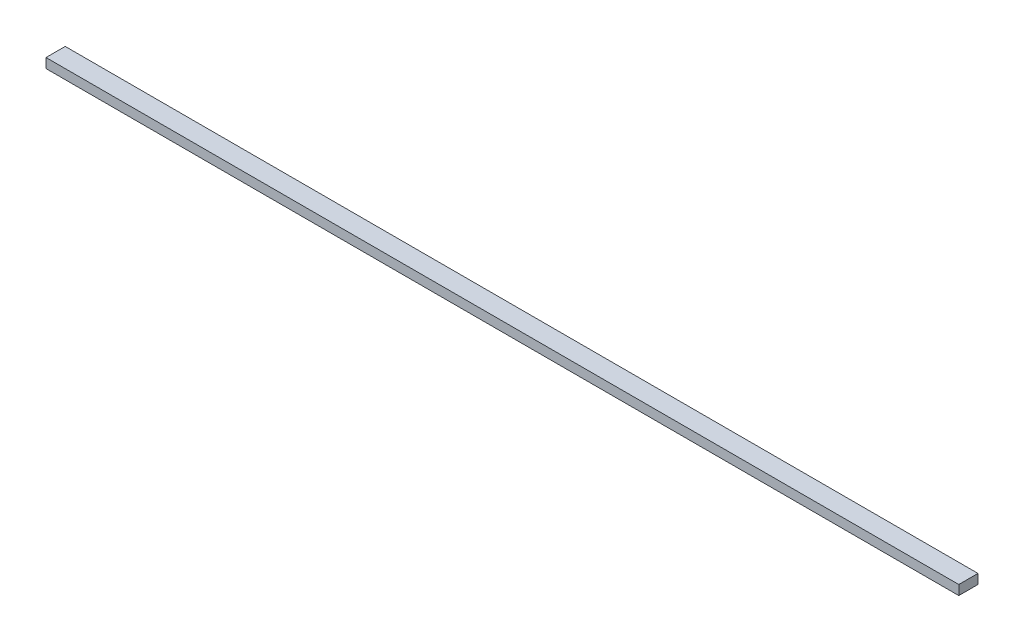
ISO-10303-21;
HEADER;
FILE_DESCRIPTION(('STEP AP214'),'2;1');
FILE_NAME('part.step','',(''),(''),'','','');
FILE_SCHEMA(('AUTOMOTIVE_DESIGN { 1 0 10303 214 1 1 1 1 }'));
ENDSEC;
DATA;
#1=APPLICATION_CONTEXT('core data for automotive mechanical design processes');
#2=APPLICATION_PROTOCOL_DEFINITION('international standard','automotive_design',2000,#1);
#3=PRODUCT_CONTEXT('',#1,'mechanical');
#4=PRODUCT('Part','Part','',(#3));
#5=PRODUCT_RELATED_PRODUCT_CATEGORY('part','',(#4));
#6=PRODUCT_DEFINITION_FORMATION('','',#4);
#7=PRODUCT_DEFINITION_CONTEXT('part definition',#1,'design');
#8=PRODUCT_DEFINITION('design','',#6,#7);
#9=PRODUCT_DEFINITION_SHAPE('','',#8);
#10=(LENGTH_UNIT() NAMED_UNIT(*) SI_UNIT(.MILLI.,.METRE.));
#11=(NAMED_UNIT(*) PLANE_ANGLE_UNIT() SI_UNIT($,.RADIAN.));
#12=(NAMED_UNIT(*) SI_UNIT($,.STERADIAN.) SOLID_ANGLE_UNIT());
#13=UNCERTAINTY_MEASURE_WITH_UNIT(LENGTH_MEASURE(1.E-05),#10,'distance_accuracy_value','');
#14=(GEOMETRIC_REPRESENTATION_CONTEXT(3) GLOBAL_UNCERTAINTY_ASSIGNED_CONTEXT((#13)) GLOBAL_UNIT_ASSIGNED_CONTEXT((#10,
#11,#12)) REPRESENTATION_CONTEXT('',''));
#15=CARTESIAN_POINT('',(0.,0.,0.));
#16=DIRECTION('',(0.,0.,1.));
#17=DIRECTION('',(1.,0.,0.));
#18=AXIS2_PLACEMENT_3D('',#15,#16,#17);
#19=CARTESIAN_POINT('',(0.,0.,100.));
#20=DIRECTION('',(1.,0.,0.));
#21=DIRECTION('',(0.,0.,-1.));
#22=AXIS2_PLACEMENT_3D('',#19,#20,#21);
#23=PLANE('',#22);
#24=DIRECTION('',(0.,-1.,0.));
#25=VECTOR('',#24,1.);
#26=CARTESIAN_POINT('',(0.,0.,0.));
#27=LINE('',#26,#25);
#28=CARTESIAN_POINT('',(0.,50.,0.));
#29=VERTEX_POINT('',#28);
#30=CARTESIAN_POINT('',(0.,0.,0.));
#31=VERTEX_POINT('',#30);
#32=EDGE_CURVE('E100',#29,#31,#27,.T.);
#33=ORIENTED_EDGE('',*,*,#32,.T.);
#34=DIRECTION('',(0.,0.,-1.));
#35=VECTOR('',#34,1.);
#36=CARTESIAN_POINT('',(0.,0.,100.));
#37=LINE('',#36,#35);
#38=CARTESIAN_POINT('',(0.,0.,100.));
#39=VERTEX_POINT('',#38);
#40=EDGE_CURVE('E11',#39,#31,#37,.T.);
#41=ORIENTED_EDGE('',*,*,#40,.F.);
#42=DIRECTION('',(0.,-1.,0.));
#43=VECTOR('',#42,1.);
#44=CARTESIAN_POINT('',(0.,0.,100.));
#45=LINE('',#44,#43);
#46=CARTESIAN_POINT('',(0.,50.,100.));
#47=VERTEX_POINT('',#46);
#48=EDGE_CURVE('E88',#47,#39,#45,.T.);
#49=ORIENTED_EDGE('',*,*,#48,.F.);
#50=DIRECTION('',(0.,0.,-1.));
#51=VECTOR('',#50,1.);
#52=CARTESIAN_POINT('',(0.,50.,100.));
#53=LINE('',#52,#51);
#54=EDGE_CURVE('E96',#47,#29,#53,.T.);
#55=ORIENTED_EDGE('',*,*,#54,.T.);
#56=EDGE_LOOP('',(#33,#41,#49,#55));
#57=FACE_BOUND('',#56,.T.);
#58=ADVANCED_FACE('F37',(#57),#23,.F.);
#59=CARTESIAN_POINT('',(0.,0.,100.));
#60=DIRECTION('',(0.,1.,0.));
#61=DIRECTION('',(0.,0.,1.));
#62=AXIS2_PLACEMENT_3D('',#59,#60,#61);
#63=PLANE('',#62);
#64=DIRECTION('',(1.,0.,0.));
#65=VECTOR('',#64,1.);
#66=CARTESIAN_POINT('',(0.,0.,0.));
#67=LINE('',#66,#65);
#68=CARTESIAN_POINT('',(4750.,0.,0.));
#69=VERTEX_POINT('',#68);
#70=EDGE_CURVE('E92',#31,#69,#67,.T.);
#71=ORIENTED_EDGE('',*,*,#70,.T.);
#72=DIRECTION('',(0.,0.,-1.));
#73=VECTOR('',#72,1.);
#74=CARTESIAN_POINT('',(4750.,0.,100.));
#75=LINE('',#74,#73);
#76=CARTESIAN_POINT('',(4750.,0.,100.));
#77=VERTEX_POINT('',#76);
#78=EDGE_CURVE('E45',#77,#69,#75,.T.);
#79=ORIENTED_EDGE('',*,*,#78,.F.);
#80=DIRECTION('',(1.,0.,0.));
#81=VECTOR('',#80,1.);
#82=CARTESIAN_POINT('',(0.,0.,100.));
#83=LINE('',#82,#81);
#84=EDGE_CURVE('E83',#39,#77,#83,.T.);
#85=ORIENTED_EDGE('',*,*,#84,.F.);
#86=ORIENTED_EDGE('',*,*,#40,.T.);
#87=EDGE_LOOP('',(#71,#79,#85,#86));
#88=FACE_BOUND('',#87,.T.);
#89=ADVANCED_FACE('F91',(#88),#63,.F.);
#90=CARTESIAN_POINT('',(4750.,0.,100.));
#91=DIRECTION('',(-1.,0.,0.));
#92=DIRECTION('',(0.,0.,1.));
#93=AXIS2_PLACEMENT_3D('',#90,#91,#92);
#94=PLANE('',#93);
#95=DIRECTION('',(0.,1.,0.));
#96=VECTOR('',#95,1.);
#97=CARTESIAN_POINT('',(4750.,0.,0.));
#98=LINE('',#97,#96);
#99=CARTESIAN_POINT('',(4750.,50.,0.));
#100=VERTEX_POINT('',#99);
#101=EDGE_CURVE('E70',#69,#100,#98,.T.);
#102=ORIENTED_EDGE('',*,*,#101,.T.);
#103=DIRECTION('',(0.,0.,-1.));
#104=VECTOR('',#103,1.);
#105=CARTESIAN_POINT('',(4750.,50.,100.));
#106=LINE('',#105,#104);
#107=CARTESIAN_POINT('',(4750.,50.,100.));
#108=VERTEX_POINT('',#107);
#109=EDGE_CURVE('E93',#108,#100,#106,.T.);
#110=ORIENTED_EDGE('',*,*,#109,.F.);
#111=DIRECTION('',(0.,1.,0.));
#112=VECTOR('',#111,1.);
#113=CARTESIAN_POINT('',(4750.,0.,100.));
#114=LINE('',#113,#112);
#115=EDGE_CURVE('E86',#77,#108,#114,.T.);
#116=ORIENTED_EDGE('',*,*,#115,.F.);
#117=ORIENTED_EDGE('',*,*,#78,.T.);
#118=EDGE_LOOP('',(#102,#110,#116,#117));
#119=FACE_BOUND('',#118,.T.);
#120=ADVANCED_FACE('F94',(#119),#94,.F.);
#121=CARTESIAN_POINT('',(0.,50.,100.));
#122=DIRECTION('',(0.,-1.,0.));
#123=DIRECTION('',(0.,0.,-1.));
#124=AXIS2_PLACEMENT_3D('',#121,#122,#123);
#125=PLANE('',#124);
#126=DIRECTION('',(-1.,0.,0.));
#127=VECTOR('',#126,1.);
#128=CARTESIAN_POINT('',(0.,50.,0.));
#129=LINE('',#128,#127);
#130=EDGE_CURVE('E76',#100,#29,#129,.T.);
#131=ORIENTED_EDGE('',*,*,#130,.T.);
#132=ORIENTED_EDGE('',*,*,#54,.F.);
#133=DIRECTION('',(-1.,0.,0.));
#134=VECTOR('',#133,1.);
#135=CARTESIAN_POINT('',(0.,50.,100.));
#136=LINE('',#135,#134);
#137=EDGE_CURVE('E53',#108,#47,#136,.T.);
#138=ORIENTED_EDGE('',*,*,#137,.F.);
#139=ORIENTED_EDGE('',*,*,#109,.T.);
#140=EDGE_LOOP('',(#131,#132,#138,#139));
#141=FACE_BOUND('',#140,.T.);
#142=ADVANCED_FACE('F107',(#141),#125,.F.);
#143=CARTESIAN_POINT('',(0.,0.,100.));
#144=DIRECTION('',(0.,0.,-1.));
#145=DIRECTION('',(-1.,0.,0.));
#146=AXIS2_PLACEMENT_3D('',#143,#144,#145);
#147=PLANE('',#146);
#148=ORIENTED_EDGE('',*,*,#48,.T.);
#149=ORIENTED_EDGE('',*,*,#84,.T.);
#150=ORIENTED_EDGE('',*,*,#115,.T.);
#151=ORIENTED_EDGE('',*,*,#137,.T.);
#152=EDGE_LOOP('',(#148,#149,#150,#151));
#153=FACE_BOUND('',#152,.T.);
#154=ADVANCED_FACE('F84',(#153),#147,.F.);
#155=CARTESIAN_POINT('',(0.,0.,0.));
#156=DIRECTION('',(0.,0.,-1.));
#157=DIRECTION('',(-1.,0.,0.));
#158=AXIS2_PLACEMENT_3D('',#155,#156,#157);
#159=PLANE('',#158);
#160=ORIENTED_EDGE('',*,*,#32,.F.);
#161=ORIENTED_EDGE('',*,*,#130,.F.);
#162=ORIENTED_EDGE('',*,*,#101,.F.);
#163=ORIENTED_EDGE('',*,*,#70,.F.);
#164=EDGE_LOOP('',(#160,#161,#162,#163));
#165=FACE_BOUND('',#164,.T.);
#166=ADVANCED_FACE('F110',(#165),#159,.T.);
#167=CLOSED_SHELL('',(#58,#89,#120,#142,#154,#166));
#168=MANIFOLD_SOLID_BREP('B2',#167);
#169=ADVANCED_BREP_SHAPE_REPRESENTATION('',(#18,#168),#14);
#170=SHAPE_DEFINITION_REPRESENTATION(#9,#169);
ENDSEC;
END-ISO-10303-21;
